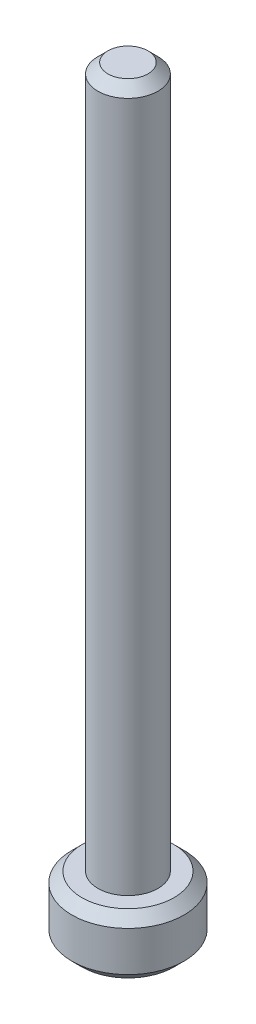
ISO-10303-21;
HEADER;
FILE_DESCRIPTION(('STEP AP214'),'2;1');
FILE_NAME('part.step','',(''),(''),'','','');
FILE_SCHEMA(('AUTOMOTIVE_DESIGN { 1 0 10303 214 1 1 1 1 }'));
ENDSEC;
DATA;
#1=APPLICATION_CONTEXT('core data for automotive mechanical design processes');
#2=APPLICATION_PROTOCOL_DEFINITION('international standard','automotive_design',2000,#1);
#3=PRODUCT_CONTEXT('',#1,'mechanical');
#4=PRODUCT('Part','Part','',(#3));
#5=PRODUCT_RELATED_PRODUCT_CATEGORY('part','',(#4));
#6=PRODUCT_DEFINITION_FORMATION('','',#4);
#7=PRODUCT_DEFINITION_CONTEXT('part definition',#1,'design');
#8=PRODUCT_DEFINITION('design','',#6,#7);
#9=PRODUCT_DEFINITION_SHAPE('','',#8);
#10=(LENGTH_UNIT() NAMED_UNIT(*) SI_UNIT(.MILLI.,.METRE.));
#11=(NAMED_UNIT(*) PLANE_ANGLE_UNIT() SI_UNIT($,.RADIAN.));
#12=(NAMED_UNIT(*) SI_UNIT($,.STERADIAN.) SOLID_ANGLE_UNIT());
#13=UNCERTAINTY_MEASURE_WITH_UNIT(LENGTH_MEASURE(1.E-05),#10,'distance_accuracy_value','');
#14=(GEOMETRIC_REPRESENTATION_CONTEXT(3) GLOBAL_UNCERTAINTY_ASSIGNED_CONTEXT((#13)) GLOBAL_UNIT_ASSIGNED_CONTEXT((#10,
#11,#12)) REPRESENTATION_CONTEXT('',''));
#15=CARTESIAN_POINT('',(0.,0.,0.));
#16=DIRECTION('',(0.,0.,1.));
#17=DIRECTION('',(1.,0.,0.));
#18=AXIS2_PLACEMENT_3D('',#15,#16,#17);
#19=CARTESIAN_POINT('',(0.,1.5,0.));
#20=DIRECTION('',(0.,-1.,0.));
#21=DIRECTION('',(0.,0.,-1.));
#22=AXIS2_PLACEMENT_3D('',#19,#20,#21);
#23=CYLINDRICAL_SURFACE('',#22,2.8);
#24=CARTESIAN_POINT('',(0.,1.,0.));
#25=DIRECTION('',(0.,1.,0.));
#26=DIRECTION('',(0.,0.,1.));
#27=AXIS2_PLACEMENT_3D('',#24,#25,#26);
#28=CIRCLE('',#27,2.8);
#29=CARTESIAN_POINT('',(0.,1.,2.8));
#30=VERTEX_POINT('',#29);
#31=EDGE_CURVE('E44',#30,#30,#28,.F.);
#32=ORIENTED_EDGE('',*,*,#31,.T.);
#33=EDGE_LOOP('',(#32));
#34=FACE_BOUND('',#33,.T.);
#35=CARTESIAN_POINT('',(0.,-0.999999999999985,0.));
#36=DIRECTION('',(0.,1.,0.));
#37=DIRECTION('',(0.,0.,1.));
#38=AXIS2_PLACEMENT_3D('',#35,#36,#37);
#39=CIRCLE('',#38,2.8);
#40=CARTESIAN_POINT('',(0.,-0.999999999999985,2.8));
#41=VERTEX_POINT('',#40);
#42=EDGE_CURVE('E48',#41,#41,#39,.T.);
#43=ORIENTED_EDGE('',*,*,#42,.T.);
#44=EDGE_LOOP('',(#43));
#45=FACE_BOUND('',#44,.T.);
#46=ADVANCED_FACE('F36',(#34,#45),#23,.T.);
#47=CARTESIAN_POINT('',(0.,1.5,0.));
#48=DIRECTION('',(0.,1.,0.));
#49=DIRECTION('',(0.,0.,1.));
#50=AXIS2_PLACEMENT_3D('',#47,#48,#49);
#51=PLANE('',#50);
#52=CARTESIAN_POINT('',(0.,1.5,0.));
#53=DIRECTION('',(0.,1.,0.));
#54=DIRECTION('',(0.,0.,1.));
#55=AXIS2_PLACEMENT_3D('',#52,#53,#54);
#56=CIRCLE('',#55,2.3);
#57=CARTESIAN_POINT('',(0.,1.5,2.3));
#58=VERTEX_POINT('',#57);
#59=EDGE_CURVE('E52',#58,#58,#56,.T.);
#60=ORIENTED_EDGE('',*,*,#59,.T.);
#61=EDGE_LOOP('',(#60));
#62=FACE_BOUND('',#61,.T.);
#63=CARTESIAN_POINT('',(0.,1.5,0.));
#64=DIRECTION('',(0.,1.,0.));
#65=DIRECTION('',(0.,0.,1.));
#66=AXIS2_PLACEMENT_3D('',#63,#64,#65);
#67=CIRCLE('',#66,1.5);
#68=CARTESIAN_POINT('',(0.,1.5,1.5));
#69=VERTEX_POINT('',#68);
#70=EDGE_CURVE('E63',#69,#69,#67,.T.);
#71=ORIENTED_EDGE('',*,*,#70,.F.);
#72=EDGE_LOOP('',(#71));
#73=FACE_BOUND('',#72,.T.);
#74=ADVANCED_FACE('F69',(#62,#73),#51,.T.);
#75=CARTESIAN_POINT('',(0.,-1.5,0.));
#76=DIRECTION('',(0.,1.,0.));
#77=DIRECTION('',(0.,0.,1.));
#78=AXIS2_PLACEMENT_3D('',#75,#76,#77);
#79=PLANE('',#78);
#80=CARTESIAN_POINT('',(0.,-1.5,0.));
#81=DIRECTION('',(0.,1.,0.));
#82=DIRECTION('',(0.,0.,1.));
#83=AXIS2_PLACEMENT_3D('',#80,#81,#82);
#84=CIRCLE('',#83,2.29999999999998);
#85=CARTESIAN_POINT('',(0.,-1.5,2.29999999999998));
#86=VERTEX_POINT('',#85);
#87=EDGE_CURVE('E10',#86,#86,#84,.F.);
#88=ORIENTED_EDGE('',*,*,#87,.T.);
#89=EDGE_LOOP('',(#88));
#90=FACE_BOUND('',#89,.T.);
#91=ADVANCED_FACE('F71',(#90),#79,.F.);
#92=CARTESIAN_POINT('',(0.,36.5,0.));
#93=DIRECTION('',(0.,-1.,0.));
#94=DIRECTION('',(0.,0.,-1.));
#95=AXIS2_PLACEMENT_3D('',#92,#93,#94);
#96=CYLINDRICAL_SURFACE('',#95,1.5);
#97=CARTESIAN_POINT('',(0.,36.,0.));
#98=DIRECTION('',(0.,1.,0.));
#99=DIRECTION('',(0.,0.,1.));
#100=AXIS2_PLACEMENT_3D('',#97,#98,#99);
#101=CIRCLE('',#100,1.5);
#102=CARTESIAN_POINT('',(0.,36.,1.5));
#103=VERTEX_POINT('',#102);
#104=EDGE_CURVE('E57',#103,#103,#101,.F.);
#105=ORIENTED_EDGE('',*,*,#104,.T.);
#106=EDGE_LOOP('',(#105));
#107=FACE_BOUND('',#106,.T.);
#108=ORIENTED_EDGE('',*,*,#70,.T.);
#109=EDGE_LOOP('',(#108));
#110=FACE_BOUND('',#109,.T.);
#111=ADVANCED_FACE('F67',(#107,#110),#96,.T.);
#112=CARTESIAN_POINT('',(0.,36.5,0.));
#113=DIRECTION('',(0.,1.,0.));
#114=DIRECTION('',(0.,0.,1.));
#115=AXIS2_PLACEMENT_3D('',#112,#113,#114);
#116=PLANE('',#115);
#117=CARTESIAN_POINT('',(0.,36.5,0.));
#118=DIRECTION('',(0.,1.,0.));
#119=DIRECTION('',(0.,0.,1.));
#120=AXIS2_PLACEMENT_3D('',#117,#118,#119);
#121=CIRCLE('',#120,1.00000000000001);
#122=CARTESIAN_POINT('',(0.,36.5,1.00000000000001));
#123=VERTEX_POINT('',#122);
#124=EDGE_CURVE('E60',#123,#123,#121,.T.);
#125=ORIENTED_EDGE('',*,*,#124,.T.);
#126=EDGE_LOOP('',(#125));
#127=FACE_BOUND('',#126,.T.);
#128=ADVANCED_FACE('F90',(#127),#116,.T.);
#129=CARTESIAN_POINT('',(0.,36.5,0.));
#130=DIRECTION('',(0.,-1.,0.));
#131=DIRECTION('',(0.,0.,-1.));
#132=AXIS2_PLACEMENT_3D('',#129,#130,#131);
#133=CONICAL_SURFACE('',#132,1.00000000000001,0.785398163397444);
#134=ORIENTED_EDGE('',*,*,#104,.F.);
#135=EDGE_LOOP('',(#134));
#136=FACE_BOUND('',#135,.T.);
#137=ORIENTED_EDGE('',*,*,#124,.F.);
#138=EDGE_LOOP('',(#137));
#139=FACE_BOUND('',#138,.T.);
#140=ADVANCED_FACE('F84',(#136,#139),#133,.T.);
#141=CARTESIAN_POINT('',(0.,1.5,0.));
#142=DIRECTION('',(0.,-1.,0.));
#143=DIRECTION('',(0.,0.,-1.));
#144=AXIS2_PLACEMENT_3D('',#141,#142,#143);
#145=CONICAL_SURFACE('',#144,2.3,0.785398163397449);
#146=ORIENTED_EDGE('',*,*,#31,.F.);
#147=EDGE_LOOP('',(#146));
#148=FACE_BOUND('',#147,.T.);
#149=ORIENTED_EDGE('',*,*,#59,.F.);
#150=EDGE_LOOP('',(#149));
#151=FACE_BOUND('',#150,.T.);
#152=ADVANCED_FACE('F89',(#148,#151),#145,.T.);
#153=CARTESIAN_POINT('',(0.,-0.999999999999985,0.));
#154=DIRECTION('',(0.,1.,0.));
#155=DIRECTION('',(0.,0.,1.));
#156=AXIS2_PLACEMENT_3D('',#153,#154,#155);
#157=CONICAL_SURFACE('',#156,2.8,0.785398163397451);
#158=ORIENTED_EDGE('',*,*,#87,.F.);
#159=EDGE_LOOP('',(#158));
#160=FACE_BOUND('',#159,.T.);
#161=ORIENTED_EDGE('',*,*,#42,.F.);
#162=EDGE_LOOP('',(#161));
#163=FACE_BOUND('',#162,.T.);
#164=ADVANCED_FACE('F39',(#160,#163),#157,.T.);
#165=CLOSED_SHELL('',(#46,#74,#91,#111,#128,#140,#152,#164));
#166=MANIFOLD_SOLID_BREP('B2',#165);
#167=ADVANCED_BREP_SHAPE_REPRESENTATION('',(#18,#166),#14);
#168=SHAPE_DEFINITION_REPRESENTATION(#9,#167);
ENDSEC;
END-ISO-10303-21;
